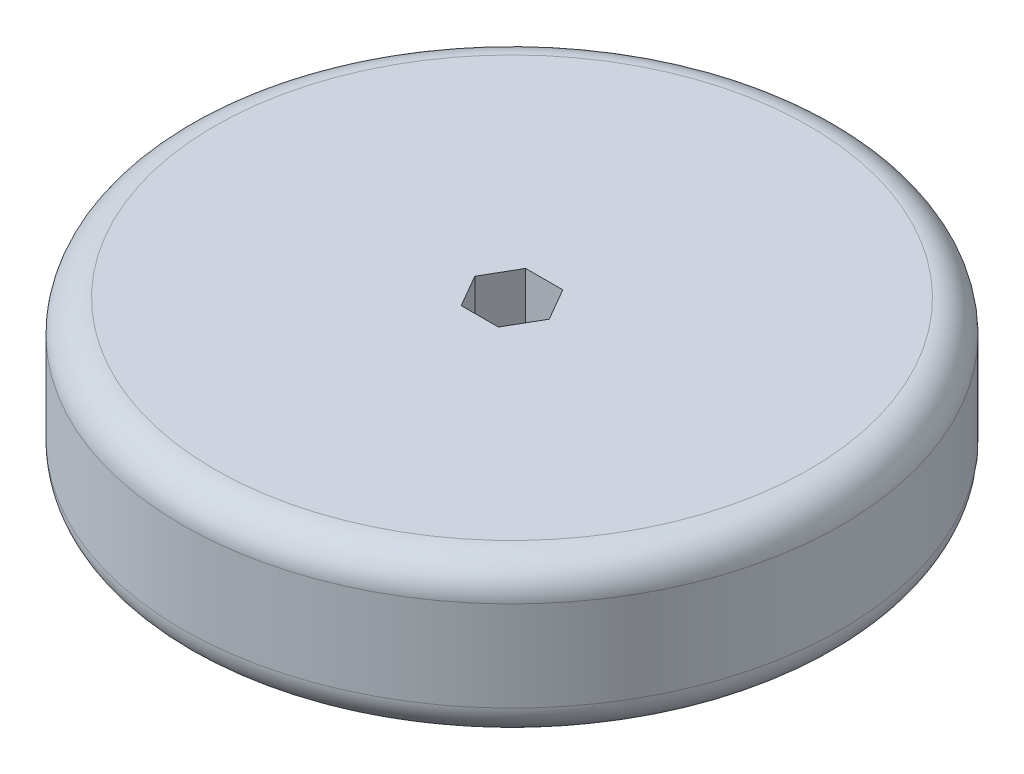
ISO-10303-21;
HEADER;
FILE_DESCRIPTION(('STEP AP214'),'2;1');
FILE_NAME('part.step','',(''),(''),'','','');
FILE_SCHEMA(('AUTOMOTIVE_DESIGN { 1 0 10303 214 1 1 1 1 }'));
ENDSEC;
DATA;
#1=APPLICATION_CONTEXT('core data for automotive mechanical design processes');
#2=APPLICATION_PROTOCOL_DEFINITION('international standard','automotive_design',2000,#1);
#3=PRODUCT_CONTEXT('',#1,'mechanical');
#4=PRODUCT('Part','Part','',(#3));
#5=PRODUCT_RELATED_PRODUCT_CATEGORY('part','',(#4));
#6=PRODUCT_DEFINITION_FORMATION('','',#4);
#7=PRODUCT_DEFINITION_CONTEXT('part definition',#1,'design');
#8=PRODUCT_DEFINITION('design','',#6,#7);
#9=PRODUCT_DEFINITION_SHAPE('','',#8);
#10=(LENGTH_UNIT() NAMED_UNIT(*) SI_UNIT(.MILLI.,.METRE.));
#11=(NAMED_UNIT(*) PLANE_ANGLE_UNIT() SI_UNIT($,.RADIAN.));
#12=(NAMED_UNIT(*) SI_UNIT($,.STERADIAN.) SOLID_ANGLE_UNIT());
#13=UNCERTAINTY_MEASURE_WITH_UNIT(LENGTH_MEASURE(1.E-05),#10,'distance_accuracy_value','');
#14=(GEOMETRIC_REPRESENTATION_CONTEXT(3) GLOBAL_UNCERTAINTY_ASSIGNED_CONTEXT((#13)) GLOBAL_UNIT_ASSIGNED_CONTEXT((#10,
#11,#12)) REPRESENTATION_CONTEXT('',''));
#15=CARTESIAN_POINT('',(0.,0.,0.));
#16=DIRECTION('',(0.,0.,1.));
#17=DIRECTION('',(1.,0.,0.));
#18=AXIS2_PLACEMENT_3D('',#15,#16,#17);
#19=CARTESIAN_POINT('',(0.,15.24,0.));
#20=DIRECTION('',(0.,-1.,0.));
#21=DIRECTION('',(0.,0.,-1.));
#22=AXIS2_PLACEMENT_3D('',#19,#20,#21);
#23=CYLINDRICAL_SURFACE('',#22,64.9605);
#24=CARTESIAN_POINT('',(0.,-8.89,0.));
#25=DIRECTION('',(0.,1.,0.));
#26=DIRECTION('',(0.,0.,1.));
#27=AXIS2_PLACEMENT_3D('',#24,#25,#26);
#28=CIRCLE('',#27,64.9605);
#29=CARTESIAN_POINT('',(0.,-8.89,64.9605));
#30=VERTEX_POINT('',#29);
#31=EDGE_CURVE('E143',#30,#30,#28,.T.);
#32=ORIENTED_EDGE('',*,*,#31,.T.);
#33=EDGE_LOOP('',(#32));
#34=FACE_BOUND('',#33,.T.);
#35=CARTESIAN_POINT('',(0.,8.89,0.));
#36=DIRECTION('',(0.,1.,0.));
#37=DIRECTION('',(0.,0.,1.));
#38=AXIS2_PLACEMENT_3D('',#35,#36,#37);
#39=CIRCLE('',#38,64.9605);
#40=CARTESIAN_POINT('',(0.,8.89,64.9605));
#41=VERTEX_POINT('',#40);
#42=EDGE_CURVE('E133',#41,#41,#39,.F.);
#43=ORIENTED_EDGE('',*,*,#42,.T.);
#44=EDGE_LOOP('',(#43));
#45=FACE_BOUND('',#44,.T.);
#46=ADVANCED_FACE('F36',(#34,#45),#23,.T.);
#47=CARTESIAN_POINT('',(0.,15.24,0.));
#48=DIRECTION('',(0.,1.,0.));
#49=DIRECTION('',(0.,0.,1.));
#50=AXIS2_PLACEMENT_3D('',#47,#48,#49);
#51=PLANE('',#50);
#52=CARTESIAN_POINT('',(0.,15.24,0.));
#53=DIRECTION('',(0.,1.,0.));
#54=DIRECTION('',(0.,0.,1.));
#55=AXIS2_PLACEMENT_3D('',#52,#53,#54);
#56=CIRCLE('',#55,58.6105);
#57=CARTESIAN_POINT('',(0.,15.24,58.6105));
#58=VERTEX_POINT('',#57);
#59=EDGE_CURVE('E11',#58,#58,#56,.T.);
#60=ORIENTED_EDGE('',*,*,#59,.T.);
#61=EDGE_LOOP('',(#60));
#62=FACE_BOUND('',#61,.T.);
#63=DIRECTION('',(0.499998950347217,0.,-0.866026009800907));
#64=VECTOR('',#63,1.);
#65=CARTESIAN_POINT('',(3.66618190576865,15.24,6.34999555646679));
#66=LINE('',#65,#64);
#67=CARTESIAN_POINT('',(3.66618190576865,15.24,6.34999555646679));
#68=VERTEX_POINT('',#67);
#69=CARTESIAN_POINT('',(7.33234841870286,15.24,-8.88705711148477E-06));
#70=VERTEX_POINT('',#69);
#71=EDGE_CURVE('E51',#68,#70,#66,.T.);
#72=ORIENTED_EDGE('',*,*,#71,.F.);
#73=DIRECTION('',(0.999999999999266,0.,-1.21203420835487E-06));
#74=VECTOR('',#73,1.);
#75=CARTESIAN_POINT('',(-3.66616651293419,15.24,6.3500044435239));
#76=LINE('',#75,#74);
#77=CARTESIAN_POINT('',(-3.66616651293419,15.24,6.3500044435239));
#78=VERTEX_POINT('',#77);
#79=EDGE_CURVE('E107',#78,#68,#76,.T.);
#80=ORIENTED_EDGE('',*,*,#79,.F.);
#81=DIRECTION('',(0.500001049652048,0.,0.866024797766698));
#82=VECTOR('',#81,1.);
#83=CARTESIAN_POINT('',(-7.33234841870285,15.24,8.88705711267694E-06));
#84=LINE('',#83,#82);
#85=CARTESIAN_POINT('',(-7.33234841870285,15.24,8.88705711267694E-06));
#86=VERTEX_POINT('',#85);
#87=EDGE_CURVE('E110',#86,#78,#84,.T.);
#88=ORIENTED_EDGE('',*,*,#87,.F.);
#89=DIRECTION('',(-0.499998950347218,0.,0.866026009800907));
#90=VECTOR('',#89,1.);
#91=CARTESIAN_POINT('',(-3.66618190576865,15.24,-6.34999555646678));
#92=LINE('',#91,#90);
#93=CARTESIAN_POINT('',(-3.66618190576865,15.24,-6.34999555646678));
#94=VERTEX_POINT('',#93);
#95=EDGE_CURVE('E126',#94,#86,#92,.T.);
#96=ORIENTED_EDGE('',*,*,#95,.F.);
#97=DIRECTION('',(-0.999999999999266,0.,1.21203420823657E-06));
#98=VECTOR('',#97,1.);
#99=CARTESIAN_POINT('',(3.66616651293421,15.24,-6.35000444352389));
#100=LINE('',#99,#98);
#101=CARTESIAN_POINT('',(3.66616651293421,15.24,-6.35000444352389));
#102=VERTEX_POINT('',#101);
#103=EDGE_CURVE('E123',#102,#94,#100,.T.);
#104=ORIENTED_EDGE('',*,*,#103,.F.);
#105=DIRECTION('',(-0.500001049652047,0.,-0.866024797766699));
#106=VECTOR('',#105,1.);
#107=CARTESIAN_POINT('',(7.33234841870286,15.24,-8.88705711122646E-06));
#108=LINE('',#107,#106);
#109=EDGE_CURVE('E121',#70,#102,#108,.T.);
#110=ORIENTED_EDGE('',*,*,#109,.F.);
#111=EDGE_LOOP('',(#72,#80,#88,#96,#104,#110));
#112=FACE_BOUND('',#111,.T.);
#113=ADVANCED_FACE('F156',(#62,#112),#51,.T.);
#114=CARTESIAN_POINT('',(0.,-15.24,0.));
#115=DIRECTION('',(0.,1.,0.));
#116=DIRECTION('',(0.,0.,1.));
#117=AXIS2_PLACEMENT_3D('',#114,#115,#116);
#118=PLANE('',#117);
#119=CARTESIAN_POINT('',(0.,-15.24,0.));
#120=DIRECTION('',(0.,1.,0.));
#121=DIRECTION('',(0.,0.,1.));
#122=AXIS2_PLACEMENT_3D('',#119,#120,#121);
#123=CIRCLE('',#122,58.6105);
#124=CARTESIAN_POINT('',(0.,-15.24,58.6105));
#125=VERTEX_POINT('',#124);
#126=EDGE_CURVE('E44',#125,#125,#123,.F.);
#127=ORIENTED_EDGE('',*,*,#126,.T.);
#128=EDGE_LOOP('',(#127));
#129=FACE_BOUND('',#128,.T.);
#130=DIRECTION('',(0.999999999999266,0.,-1.21203420835487E-06));
#131=VECTOR('',#130,1.);
#132=CARTESIAN_POINT('',(-3.66616651293419,-15.24,6.3500044435239));
#133=LINE('',#132,#131);
#134=CARTESIAN_POINT('',(-3.66616651293419,-15.24,6.3500044435239));
#135=VERTEX_POINT('',#134);
#136=CARTESIAN_POINT('',(3.66618190576865,-15.24,6.34999555646679));
#137=VERTEX_POINT('',#136);
#138=EDGE_CURVE('E97',#135,#137,#133,.T.);
#139=ORIENTED_EDGE('',*,*,#138,.T.);
#140=DIRECTION('',(0.499998950347217,0.,-0.866026009800907));
#141=VECTOR('',#140,1.);
#142=CARTESIAN_POINT('',(3.66618190576865,-15.24,6.34999555646679));
#143=LINE('',#142,#141);
#144=CARTESIAN_POINT('',(7.33234841870286,-15.24,-8.88705711122646E-06));
#145=VERTEX_POINT('',#144);
#146=EDGE_CURVE('E91',#137,#145,#143,.T.);
#147=ORIENTED_EDGE('',*,*,#146,.T.);
#148=DIRECTION('',(-0.500001049652047,0.,-0.866024797766699));
#149=VECTOR('',#148,1.);
#150=CARTESIAN_POINT('',(7.33234841870286,-15.24,-8.88705711122646E-06));
#151=LINE('',#150,#149);
#152=CARTESIAN_POINT('',(3.66616651293421,-15.24,-6.35000444352389));
#153=VERTEX_POINT('',#152);
#154=EDGE_CURVE('E100',#145,#153,#151,.T.);
#155=ORIENTED_EDGE('',*,*,#154,.T.);
#156=DIRECTION('',(-0.999999999999266,0.,1.21203420823657E-06));
#157=VECTOR('',#156,1.);
#158=CARTESIAN_POINT('',(3.66616651293421,-15.24,-6.35000444352389));
#159=LINE('',#158,#157);
#160=CARTESIAN_POINT('',(-3.66618190576865,-15.24,-6.34999555646678));
#161=VERTEX_POINT('',#160);
#162=EDGE_CURVE('E59',#153,#161,#159,.T.);
#163=ORIENTED_EDGE('',*,*,#162,.T.);
#164=DIRECTION('',(-0.499998950347218,0.,0.866026009800907));
#165=VECTOR('',#164,1.);
#166=CARTESIAN_POINT('',(-3.66618190576865,-15.24,-6.34999555646678));
#167=LINE('',#166,#165);
#168=CARTESIAN_POINT('',(-7.33234841870285,-15.24,8.88705711267694E-06));
#169=VERTEX_POINT('',#168);
#170=EDGE_CURVE('E114',#161,#169,#167,.T.);
#171=ORIENTED_EDGE('',*,*,#170,.T.);
#172=DIRECTION('',(0.500001049652048,0.,0.866024797766698));
#173=VECTOR('',#172,1.);
#174=CARTESIAN_POINT('',(-7.33234841870285,-15.24,8.88705711267694E-06));
#175=LINE('',#174,#173);
#176=EDGE_CURVE('E117',#169,#135,#175,.T.);
#177=ORIENTED_EDGE('',*,*,#176,.T.);
#178=EDGE_LOOP('',(#139,#147,#155,#163,#171,#177));
#179=FACE_BOUND('',#178,.T.);
#180=ADVANCED_FACE('F104',(#129,#179),#118,.F.);
#181=CARTESIAN_POINT('',(3.66618190576865,-15.24,6.34999555646679));
#182=DIRECTION('',(0.866026009800907,0.,0.499998950347217));
#183=DIRECTION('',(0.499998950347217,0.,-0.866026009800907));
#184=AXIS2_PLACEMENT_3D('',#181,#182,#183);
#185=PLANE('',#184);
#186=ORIENTED_EDGE('',*,*,#71,.T.);
#187=DIRECTION('',(0.,1.,0.));
#188=VECTOR('',#187,1.);
#189=CARTESIAN_POINT('',(7.33234841870286,-15.24,-8.88705711122646E-06));
#190=LINE('',#189,#188);
#191=EDGE_CURVE('E87',#145,#70,#190,.T.);
#192=ORIENTED_EDGE('',*,*,#191,.F.);
#193=ORIENTED_EDGE('',*,*,#146,.F.);
#194=DIRECTION('',(0.,1.,0.));
#195=VECTOR('',#194,1.);
#196=CARTESIAN_POINT('',(3.66618190576865,-15.24,6.34999555646679));
#197=LINE('',#196,#195);
#198=EDGE_CURVE('E131',#137,#68,#197,.T.);
#199=ORIENTED_EDGE('',*,*,#198,.T.);
#200=EDGE_LOOP('',(#186,#192,#193,#199));
#201=FACE_BOUND('',#200,.T.);
#202=ADVANCED_FACE('F89',(#201),#185,.F.);
#203=CARTESIAN_POINT('',(-3.66616651293419,-15.24,6.3500044435239));
#204=DIRECTION('',(1.21203420835487E-06,0.,0.999999999999265));
#205=DIRECTION('',(0.999999999999265,0.,-1.21203420835487E-06));
#206=AXIS2_PLACEMENT_3D('',#203,#204,#205);
#207=PLANE('',#206);
#208=ORIENTED_EDGE('',*,*,#79,.T.);
#209=ORIENTED_EDGE('',*,*,#198,.F.);
#210=ORIENTED_EDGE('',*,*,#138,.F.);
#211=DIRECTION('',(0.,1.,0.));
#212=VECTOR('',#211,1.);
#213=CARTESIAN_POINT('',(-3.66616651293419,-15.24,6.3500044435239));
#214=LINE('',#213,#212);
#215=EDGE_CURVE('E134',#135,#78,#214,.T.);
#216=ORIENTED_EDGE('',*,*,#215,.T.);
#217=EDGE_LOOP('',(#208,#209,#210,#216));
#218=FACE_BOUND('',#217,.T.);
#219=ADVANCED_FACE('F179',(#218),#207,.F.);
#220=CARTESIAN_POINT('',(-7.33234841870285,-15.24,8.88705711267694E-06));
#221=DIRECTION('',(-0.866024797766698,0.,0.500001049652048));
#222=DIRECTION('',(0.500001049652048,0.,0.866024797766698));
#223=AXIS2_PLACEMENT_3D('',#220,#221,#222);
#224=PLANE('',#223);
#225=ORIENTED_EDGE('',*,*,#87,.T.);
#226=ORIENTED_EDGE('',*,*,#215,.F.);
#227=ORIENTED_EDGE('',*,*,#176,.F.);
#228=DIRECTION('',(0.,1.,0.));
#229=VECTOR('',#228,1.);
#230=CARTESIAN_POINT('',(-7.33234841870285,-15.24,8.88705711267694E-06));
#231=LINE('',#230,#229);
#232=EDGE_CURVE('E136',#169,#86,#231,.T.);
#233=ORIENTED_EDGE('',*,*,#232,.T.);
#234=EDGE_LOOP('',(#225,#226,#227,#233));
#235=FACE_BOUND('',#234,.T.);
#236=ADVANCED_FACE('F177',(#235),#224,.F.);
#237=CARTESIAN_POINT('',(-3.66618190576865,-15.24,-6.34999555646678));
#238=DIRECTION('',(-0.866026009800907,0.,-0.499998950347218));
#239=DIRECTION('',(-0.499998950347218,0.,0.866026009800907));
#240=AXIS2_PLACEMENT_3D('',#237,#238,#239);
#241=PLANE('',#240);
#242=ORIENTED_EDGE('',*,*,#95,.T.);
#243=ORIENTED_EDGE('',*,*,#232,.F.);
#244=ORIENTED_EDGE('',*,*,#170,.F.);
#245=DIRECTION('',(0.,1.,0.));
#246=VECTOR('',#245,1.);
#247=CARTESIAN_POINT('',(-3.66618190576865,-15.24,-6.34999555646678));
#248=LINE('',#247,#246);
#249=EDGE_CURVE('E138',#161,#94,#248,.T.);
#250=ORIENTED_EDGE('',*,*,#249,.T.);
#251=EDGE_LOOP('',(#242,#243,#244,#250));
#252=FACE_BOUND('',#251,.T.);
#253=ADVANCED_FACE('F174',(#252),#241,.F.);
#254=CARTESIAN_POINT('',(3.66616651293421,-15.24,-6.35000444352389));
#255=DIRECTION('',(-1.21203420823657E-06,0.,-0.999999999999265));
#256=DIRECTION('',(-0.999999999999265,0.,1.21203420823657E-06));
#257=AXIS2_PLACEMENT_3D('',#254,#255,#256);
#258=PLANE('',#257);
#259=ORIENTED_EDGE('',*,*,#103,.T.);
#260=ORIENTED_EDGE('',*,*,#249,.F.);
#261=ORIENTED_EDGE('',*,*,#162,.F.);
#262=DIRECTION('',(0.,1.,0.));
#263=VECTOR('',#262,1.);
#264=CARTESIAN_POINT('',(3.66616651293421,-15.24,-6.35000444352389));
#265=LINE('',#264,#263);
#266=EDGE_CURVE('E96',#153,#102,#265,.T.);
#267=ORIENTED_EDGE('',*,*,#266,.T.);
#268=EDGE_LOOP('',(#259,#260,#261,#267));
#269=FACE_BOUND('',#268,.T.);
#270=ADVANCED_FACE('F171',(#269),#258,.F.);
#271=CARTESIAN_POINT('',(7.33234841870286,-15.24,-8.88705711122646E-06));
#272=DIRECTION('',(0.866024797766699,0.,-0.500001049652047));
#273=DIRECTION('',(-0.500001049652047,0.,-0.866024797766699));
#274=AXIS2_PLACEMENT_3D('',#271,#272,#273);
#275=PLANE('',#274);
#276=ORIENTED_EDGE('',*,*,#109,.T.);
#277=ORIENTED_EDGE('',*,*,#266,.F.);
#278=ORIENTED_EDGE('',*,*,#154,.F.);
#279=ORIENTED_EDGE('',*,*,#191,.T.);
#280=EDGE_LOOP('',(#276,#277,#278,#279));
#281=FACE_BOUND('',#280,.T.);
#282=ADVANCED_FACE('F101',(#281),#275,.F.);
#283=CARTESIAN_POINT('',(0.,-8.89,0.));
#284=DIRECTION('',(0.,1.,0.));
#285=DIRECTION('',(0.,0.,1.));
#286=AXIS2_PLACEMENT_3D('',#283,#284,#285);
#287=TOROIDAL_SURFACE('',#286,58.6105,6.35);
#288=ORIENTED_EDGE('',*,*,#126,.F.);
#289=EDGE_LOOP('',(#288));
#290=FACE_BOUND('',#289,.T.);
#291=ORIENTED_EDGE('',*,*,#31,.F.);
#292=EDGE_LOOP('',(#291));
#293=FACE_BOUND('',#292,.T.);
#294=ADVANCED_FACE('F149',(#290,#293),#287,.T.);
#295=CARTESIAN_POINT('',(0.,8.89,0.));
#296=DIRECTION('',(0.,1.,0.));
#297=DIRECTION('',(0.,0.,1.));
#298=AXIS2_PLACEMENT_3D('',#295,#296,#297);
#299=TOROIDAL_SURFACE('',#298,58.6105,6.35);
#300=ORIENTED_EDGE('',*,*,#42,.F.);
#301=EDGE_LOOP('',(#300));
#302=FACE_BOUND('',#301,.T.);
#303=ORIENTED_EDGE('',*,*,#59,.F.);
#304=EDGE_LOOP('',(#303));
#305=FACE_BOUND('',#304,.T.);
#306=ADVANCED_FACE('F38',(#302,#305),#299,.T.);
#307=CLOSED_SHELL('',(#46,#113,#180,#202,#219,#236,#253,#270,#282,#294,#306));
#308=MANIFOLD_SOLID_BREP('B2',#307);
#309=ADVANCED_BREP_SHAPE_REPRESENTATION('',(#18,#308),#14);
#310=SHAPE_DEFINITION_REPRESENTATION(#9,#309);
ENDSEC;
END-ISO-10303-21;
